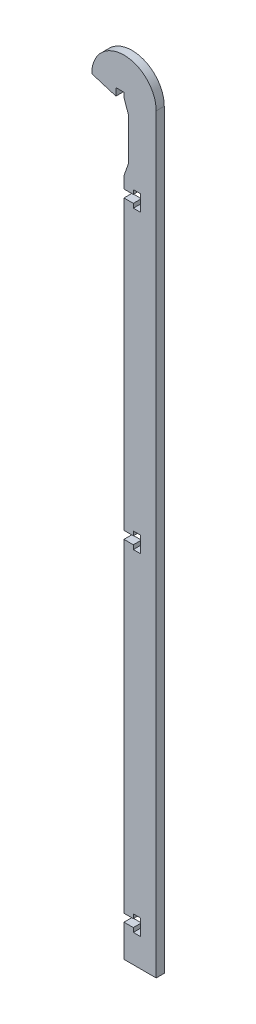
ISO-10303-21;
HEADER;
FILE_DESCRIPTION(('STEP AP214'),'2;1');
FILE_NAME('part.step','',(''),(''),'','','');
FILE_SCHEMA(('AUTOMOTIVE_DESIGN { 1 0 10303 214 1 1 1 1 }'));
ENDSEC;
DATA;
#1=APPLICATION_CONTEXT('core data for automotive mechanical design processes');
#2=APPLICATION_PROTOCOL_DEFINITION('international standard','automotive_design',2000,#1);
#3=PRODUCT_CONTEXT('',#1,'mechanical');
#4=PRODUCT('Part','Part','',(#3));
#5=PRODUCT_RELATED_PRODUCT_CATEGORY('part','',(#4));
#6=PRODUCT_DEFINITION_FORMATION('','',#4);
#7=PRODUCT_DEFINITION_CONTEXT('part definition',#1,'design');
#8=PRODUCT_DEFINITION('design','',#6,#7);
#9=PRODUCT_DEFINITION_SHAPE('','',#8);
#10=(LENGTH_UNIT() NAMED_UNIT(*) SI_UNIT(.MILLI.,.METRE.));
#11=(NAMED_UNIT(*) PLANE_ANGLE_UNIT() SI_UNIT($,.RADIAN.));
#12=(NAMED_UNIT(*) SI_UNIT($,.STERADIAN.) SOLID_ANGLE_UNIT());
#13=UNCERTAINTY_MEASURE_WITH_UNIT(LENGTH_MEASURE(1.E-05),#10,'distance_accuracy_value','');
#14=(GEOMETRIC_REPRESENTATION_CONTEXT(3) GLOBAL_UNCERTAINTY_ASSIGNED_CONTEXT((#13)) GLOBAL_UNIT_ASSIGNED_CONTEXT((#10,
#11,#12)) REPRESENTATION_CONTEXT('',''));
#15=CARTESIAN_POINT('',(0.,0.,0.));
#16=DIRECTION('',(0.,0.,1.));
#17=DIRECTION('',(1.,0.,0.));
#18=AXIS2_PLACEMENT_3D('',#15,#16,#17);
#19=CARTESIAN_POINT('',(0.,0.,3.175));
#20=DIRECTION('',(0.,1.,0.));
#21=DIRECTION('',(-1.,0.,0.));
#22=AXIS2_PLACEMENT_3D('',#19,#20,#21);
#23=PLANE('',#22);
#24=DIRECTION('',(1.,0.,0.));
#25=VECTOR('',#24,1.);
#26=CARTESIAN_POINT('',(0.,0.,0.));
#27=LINE('',#26,#25);
#28=CARTESIAN_POINT('',(-3.175,0.,0.));
#29=VERTEX_POINT('',#28);
#30=CARTESIAN_POINT('',(0.,0.,0.));
#31=VERTEX_POINT('',#30);
#32=EDGE_CURVE('E291',#29,#31,#27,.T.);
#33=ORIENTED_EDGE('',*,*,#32,.T.);
#34=DIRECTION('',(0.,0.,-1.));
#35=VECTOR('',#34,1.);
#36=CARTESIAN_POINT('',(0.,0.,3.175));
#37=LINE('',#36,#35);
#38=CARTESIAN_POINT('',(0.,0.,3.175));
#39=VERTEX_POINT('',#38);
#40=EDGE_CURVE('E11',#39,#31,#37,.T.);
#41=ORIENTED_EDGE('',*,*,#40,.F.);
#42=DIRECTION('',(1.,0.,0.));
#43=VECTOR('',#42,1.);
#44=CARTESIAN_POINT('',(0.,0.,3.175));
#45=LINE('',#44,#43);
#46=CARTESIAN_POINT('',(-3.175,0.,3.175));
#47=VERTEX_POINT('',#46);
#48=EDGE_CURVE('E359',#47,#39,#45,.T.);
#49=ORIENTED_EDGE('',*,*,#48,.F.);
#50=DIRECTION('',(0.,0.,-1.));
#51=VECTOR('',#50,1.);
#52=CARTESIAN_POINT('',(-3.175,0.,3.175));
#53=LINE('',#52,#51);
#54=EDGE_CURVE('E287',#47,#29,#53,.T.);
#55=ORIENTED_EDGE('',*,*,#54,.T.);
#56=EDGE_LOOP('',(#33,#41,#49,#55));
#57=FACE_BOUND('',#56,.T.);
#58=ADVANCED_FACE('F33',(#57),#23,.F.);
#59=CARTESIAN_POINT('',(0.,0.,3.175));
#60=DIRECTION('',(1.,0.,0.));
#61=DIRECTION('',(0.,1.,0.));
#62=AXIS2_PLACEMENT_3D('',#59,#60,#61);
#63=PLANE('',#62);
#64=DIRECTION('',(0.,-1.,0.));
#65=VECTOR('',#64,1.);
#66=CARTESIAN_POINT('',(0.,0.,0.));
#67=LINE('',#66,#65);
#68=CARTESIAN_POINT('',(0.,-1.8034,0.));
#69=VERTEX_POINT('',#68);
#70=EDGE_CURVE('E294',#31,#69,#67,.T.);
#71=ORIENTED_EDGE('',*,*,#70,.T.);
#72=DIRECTION('',(0.,0.,-1.));
#73=VECTOR('',#72,1.);
#74=CARTESIAN_POINT('',(0.,-1.8034,3.175));
#75=LINE('',#74,#73);
#76=CARTESIAN_POINT('',(0.,-1.8034,3.175));
#77=VERTEX_POINT('',#76);
#78=EDGE_CURVE('E41',#77,#69,#75,.T.);
#79=ORIENTED_EDGE('',*,*,#78,.F.);
#80=DIRECTION('',(0.,-1.,0.));
#81=VECTOR('',#80,1.);
#82=CARTESIAN_POINT('',(0.,0.,3.175));
#83=LINE('',#82,#81);
#84=EDGE_CURVE('E173',#39,#77,#83,.T.);
#85=ORIENTED_EDGE('',*,*,#84,.F.);
#86=ORIENTED_EDGE('',*,*,#40,.T.);
#87=EDGE_LOOP('',(#71,#79,#85,#86));
#88=FACE_BOUND('',#87,.T.);
#89=ADVANCED_FACE('F552',(#88),#63,.F.);
#90=CARTESIAN_POINT('',(0.,-1.8034,3.175));
#91=DIRECTION('',(0.943858356366017,0.330350424728106,0.));
#92=DIRECTION('',(-0.330350424728106,0.943858356366017,0.));
#93=AXIS2_PLACEMENT_3D('',#90,#91,#92);
#94=PLANE('',#93);
#95=DIRECTION('',(0.330350424728106,-0.943858356366017,0.));
#96=VECTOR('',#95,1.);
#97=CARTESIAN_POINT('',(0.,-1.8034,0.));
#98=LINE('',#97,#96);
#99=CARTESIAN_POINT('',(1.778,-6.8834,0.));
#100=VERTEX_POINT('',#99);
#101=EDGE_CURVE('E296',#69,#100,#98,.T.);
#102=ORIENTED_EDGE('',*,*,#101,.T.);
#103=DIRECTION('',(0.,0.,-1.));
#104=VECTOR('',#103,1.);
#105=CARTESIAN_POINT('',(1.778,-6.8834,3.175));
#106=LINE('',#105,#104);
#107=CARTESIAN_POINT('',(1.778,-6.8834,3.175));
#108=VERTEX_POINT('',#107);
#109=EDGE_CURVE('E447',#108,#100,#106,.T.);
#110=ORIENTED_EDGE('',*,*,#109,.F.);
#111=DIRECTION('',(0.330350424728106,-0.943858356366017,0.));
#112=VECTOR('',#111,1.);
#113=CARTESIAN_POINT('',(0.,-1.8034,3.175));
#114=LINE('',#113,#112);
#115=EDGE_CURVE('E455',#77,#108,#114,.T.);
#116=ORIENTED_EDGE('',*,*,#115,.F.);
#117=ORIENTED_EDGE('',*,*,#78,.T.);
#118=EDGE_LOOP('',(#102,#110,#116,#117));
#119=FACE_BOUND('',#118,.T.);
#120=ADVANCED_FACE('F453',(#119),#94,.F.);
#121=CARTESIAN_POINT('',(1.778,-6.8834,3.175));
#122=DIRECTION('',(1.,0.,0.));
#123=DIRECTION('',(0.,1.,0.));
#124=AXIS2_PLACEMENT_3D('',#121,#122,#123);
#125=PLANE('',#124);
#126=DIRECTION('',(0.,-1.,0.));
#127=VECTOR('',#126,1.);
#128=CARTESIAN_POINT('',(1.778,-6.8834,0.));
#129=LINE('',#128,#127);
#130=CARTESIAN_POINT('',(1.778,-23.3934,0.));
#131=VERTEX_POINT('',#130);
#132=EDGE_CURVE('E298',#100,#131,#129,.T.);
#133=ORIENTED_EDGE('',*,*,#132,.T.);
#134=DIRECTION('',(0.,0.,-1.));
#135=VECTOR('',#134,1.);
#136=CARTESIAN_POINT('',(1.778,-23.3934,3.175));
#137=LINE('',#136,#135);
#138=CARTESIAN_POINT('',(1.778,-23.3934,3.175));
#139=VERTEX_POINT('',#138);
#140=EDGE_CURVE('E444',#139,#131,#137,.T.);
#141=ORIENTED_EDGE('',*,*,#140,.F.);
#142=DIRECTION('',(0.,-1.,0.));
#143=VECTOR('',#142,1.);
#144=CARTESIAN_POINT('',(1.778,-6.8834,3.175));
#145=LINE('',#144,#143);
#146=EDGE_CURVE('E473',#108,#139,#145,.T.);
#147=ORIENTED_EDGE('',*,*,#146,.F.);
#148=ORIENTED_EDGE('',*,*,#109,.T.);
#149=EDGE_LOOP('',(#133,#141,#147,#148));
#150=FACE_BOUND('',#149,.T.);
#151=ADVANCED_FACE('F464',(#150),#125,.F.);
#152=CARTESIAN_POINT('',(1.778,-23.3934,3.175));
#153=DIRECTION('',(0.943858356366017,-0.330350424728106,0.));
#154=DIRECTION('',(0.330350424728106,0.943858356366017,0.));
#155=AXIS2_PLACEMENT_3D('',#152,#153,#154);
#156=PLANE('',#155);
#157=DIRECTION('',(-0.330350424728106,-0.943858356366017,0.));
#158=VECTOR('',#157,1.);
#159=CARTESIAN_POINT('',(1.778,-23.3934,0.));
#160=LINE('',#159,#158);
#161=CARTESIAN_POINT('',(0.,-28.4734,0.));
#162=VERTEX_POINT('',#161);
#163=EDGE_CURVE('E300',#131,#162,#160,.T.);
#164=ORIENTED_EDGE('',*,*,#163,.T.);
#165=DIRECTION('',(0.,0.,-1.));
#166=VECTOR('',#165,1.);
#167=CARTESIAN_POINT('',(0.,-28.4734,3.175));
#168=LINE('',#167,#166);
#169=CARTESIAN_POINT('',(0.,-28.4734,3.175));
#170=VERTEX_POINT('',#169);
#171=EDGE_CURVE('E441',#170,#162,#168,.T.);
#172=ORIENTED_EDGE('',*,*,#171,.F.);
#173=DIRECTION('',(-0.330350424728106,-0.943858356366017,0.));
#174=VECTOR('',#173,1.);
#175=CARTESIAN_POINT('',(1.778,-23.3934,3.175));
#176=LINE('',#175,#174);
#177=EDGE_CURVE('E470',#139,#170,#176,.T.);
#178=ORIENTED_EDGE('',*,*,#177,.F.);
#179=ORIENTED_EDGE('',*,*,#140,.T.);
#180=EDGE_LOOP('',(#164,#172,#178,#179));
#181=FACE_BOUND('',#180,.T.);
#182=ADVANCED_FACE('F468',(#181),#156,.F.);
#183=CARTESIAN_POINT('',(0.,-28.4734,3.175));
#184=DIRECTION('',(1.,0.,0.));
#185=DIRECTION('',(0.,1.,0.));
#186=AXIS2_PLACEMENT_3D('',#183,#184,#185);
#187=PLANE('',#186);
#188=DIRECTION('',(0.,-1.,0.));
#189=VECTOR('',#188,1.);
#190=CARTESIAN_POINT('',(0.,-28.4734,0.));
#191=LINE('',#190,#189);
#192=CARTESIAN_POINT('',(0.,-33.02,0.));
#193=VERTEX_POINT('',#192);
#194=EDGE_CURVE('E302',#162,#193,#191,.T.);
#195=ORIENTED_EDGE('',*,*,#194,.T.);
#196=DIRECTION('',(0.,0.,-1.));
#197=VECTOR('',#196,1.);
#198=CARTESIAN_POINT('',(0.,-33.02,3.175));
#199=LINE('',#198,#197);
#200=CARTESIAN_POINT('',(0.,-33.02,3.175));
#201=VERTEX_POINT('',#200);
#202=EDGE_CURVE('E438',#201,#193,#199,.T.);
#203=ORIENTED_EDGE('',*,*,#202,.F.);
#204=DIRECTION('',(0.,-1.,0.));
#205=VECTOR('',#204,1.);
#206=CARTESIAN_POINT('',(0.,-28.4734,3.175));
#207=LINE('',#206,#205);
#208=EDGE_CURVE('E472',#170,#201,#207,.T.);
#209=ORIENTED_EDGE('',*,*,#208,.F.);
#210=ORIENTED_EDGE('',*,*,#171,.T.);
#211=EDGE_LOOP('',(#195,#203,#209,#210));
#212=FACE_BOUND('',#211,.T.);
#213=ADVANCED_FACE('F565',(#212),#187,.F.);
#214=CARTESIAN_POINT('',(0.,-33.02,3.175));
#215=DIRECTION('',(0.,1.,0.));
#216=DIRECTION('',(0.,0.,1.));
#217=AXIS2_PLACEMENT_3D('',#214,#215,#216);
#218=PLANE('',#217);
#219=DIRECTION('',(1.,0.,0.));
#220=VECTOR('',#219,1.);
#221=CARTESIAN_POINT('',(0.,-33.02,0.));
#222=LINE('',#221,#220);
#223=CARTESIAN_POINT('',(3.68299999999999,-33.02,0.));
#224=VERTEX_POINT('',#223);
#225=EDGE_CURVE('E304',#193,#224,#222,.T.);
#226=ORIENTED_EDGE('',*,*,#225,.T.);
#227=DIRECTION('',(0.,0.,-1.));
#228=VECTOR('',#227,1.);
#229=CARTESIAN_POINT('',(3.68299999999999,-33.02,3.175));
#230=LINE('',#229,#228);
#231=CARTESIAN_POINT('',(3.68299999999999,-33.02,3.175));
#232=VERTEX_POINT('',#231);
#233=EDGE_CURVE('E435',#232,#224,#230,.T.);
#234=ORIENTED_EDGE('',*,*,#233,.F.);
#235=DIRECTION('',(1.,0.,0.));
#236=VECTOR('',#235,1.);
#237=CARTESIAN_POINT('',(0.,-33.02,3.175));
#238=LINE('',#237,#236);
#239=EDGE_CURVE('E475',#201,#232,#238,.T.);
#240=ORIENTED_EDGE('',*,*,#239,.F.);
#241=ORIENTED_EDGE('',*,*,#202,.T.);
#242=EDGE_LOOP('',(#226,#234,#240,#241));
#243=FACE_BOUND('',#242,.T.);
#244=ADVANCED_FACE('F568',(#243),#218,.F.);
#245=CARTESIAN_POINT('',(3.68299999999999,-33.02,3.175));
#246=DIRECTION('',(-1.,0.,0.));
#247=DIRECTION('',(0.,-1.,0.));
#248=AXIS2_PLACEMENT_3D('',#245,#246,#247);
#249=PLANE('',#248);
#250=DIRECTION('',(0.,1.,0.));
#251=VECTOR('',#250,1.);
#252=CARTESIAN_POINT('',(3.68299999999999,-33.02,0.));
#253=LINE('',#252,#251);
#254=CARTESIAN_POINT('',(3.68299999999999,-31.369,0.));
#255=VERTEX_POINT('',#254);
#256=EDGE_CURVE('E306',#224,#255,#253,.T.);
#257=ORIENTED_EDGE('',*,*,#256,.T.);
#258=DIRECTION('',(0.,0.,-1.));
#259=VECTOR('',#258,1.);
#260=CARTESIAN_POINT('',(3.68299999999999,-31.369,3.175));
#261=LINE('',#260,#259);
#262=CARTESIAN_POINT('',(3.68299999999999,-31.369,3.175));
#263=VERTEX_POINT('',#262);
#264=EDGE_CURVE('E432',#263,#255,#261,.T.);
#265=ORIENTED_EDGE('',*,*,#264,.F.);
#266=DIRECTION('',(0.,1.,0.));
#267=VECTOR('',#266,1.);
#268=CARTESIAN_POINT('',(3.68299999999999,-33.02,3.175));
#269=LINE('',#268,#267);
#270=EDGE_CURVE('E481',#232,#263,#269,.T.);
#271=ORIENTED_EDGE('',*,*,#270,.F.);
#272=ORIENTED_EDGE('',*,*,#233,.T.);
#273=EDGE_LOOP('',(#257,#265,#271,#272));
#274=FACE_BOUND('',#273,.T.);
#275=ADVANCED_FACE('F572',(#274),#249,.F.);
#276=CARTESIAN_POINT('',(3.68299999999999,-31.369,3.175));
#277=DIRECTION('',(0.,1.,0.));
#278=DIRECTION('',(-1.,0.,0.));
#279=AXIS2_PLACEMENT_3D('',#276,#277,#278);
#280=PLANE('',#279);
#281=DIRECTION('',(1.,0.,0.));
#282=VECTOR('',#281,1.);
#283=CARTESIAN_POINT('',(3.68299999999999,-31.369,0.));
#284=LINE('',#283,#282);
#285=CARTESIAN_POINT('',(6.477,-31.369,0.));
#286=VERTEX_POINT('',#285);
#287=EDGE_CURVE('E308',#255,#286,#284,.T.);
#288=ORIENTED_EDGE('',*,*,#287,.T.);
#289=DIRECTION('',(0.,0.,-1.));
#290=VECTOR('',#289,1.);
#291=CARTESIAN_POINT('',(6.477,-31.369,3.175));
#292=LINE('',#291,#290);
#293=CARTESIAN_POINT('',(6.477,-31.369,3.175));
#294=VERTEX_POINT('',#293);
#295=EDGE_CURVE('E429',#294,#286,#292,.T.);
#296=ORIENTED_EDGE('',*,*,#295,.F.);
#297=DIRECTION('',(1.,0.,0.));
#298=VECTOR('',#297,1.);
#299=CARTESIAN_POINT('',(3.68299999999999,-31.369,3.175));
#300=LINE('',#299,#298);
#301=EDGE_CURVE('E483',#263,#294,#300,.T.);
#302=ORIENTED_EDGE('',*,*,#301,.F.);
#303=ORIENTED_EDGE('',*,*,#264,.T.);
#304=EDGE_LOOP('',(#288,#296,#302,#303));
#305=FACE_BOUND('',#304,.T.);
#306=ADVANCED_FACE('F576',(#305),#280,.F.);
#307=CARTESIAN_POINT('',(6.477,-31.369,3.175));
#308=DIRECTION('',(1.,0.,0.));
#309=DIRECTION('',(0.,0.,-1.));
#310=AXIS2_PLACEMENT_3D('',#307,#308,#309);
#311=PLANE('',#310);
#312=DIRECTION('',(0.,-1.,0.));
#313=VECTOR('',#312,1.);
#314=CARTESIAN_POINT('',(6.477,-31.369,0.));
#315=LINE('',#314,#313);
#316=CARTESIAN_POINT('',(6.477,-37.719,0.));
#317=VERTEX_POINT('',#316);
#318=EDGE_CURVE('E310',#286,#317,#315,.T.);
#319=ORIENTED_EDGE('',*,*,#318,.T.);
#320=DIRECTION('',(0.,0.,-1.));
#321=VECTOR('',#320,1.);
#322=CARTESIAN_POINT('',(6.477,-37.719,3.175));
#323=LINE('',#322,#321);
#324=CARTESIAN_POINT('',(6.477,-37.719,3.175));
#325=VERTEX_POINT('',#324);
#326=EDGE_CURVE('E426',#325,#317,#323,.T.);
#327=ORIENTED_EDGE('',*,*,#326,.F.);
#328=DIRECTION('',(0.,-1.,0.));
#329=VECTOR('',#328,1.);
#330=CARTESIAN_POINT('',(6.477,-31.369,3.175));
#331=LINE('',#330,#329);
#332=EDGE_CURVE('E485',#294,#325,#331,.T.);
#333=ORIENTED_EDGE('',*,*,#332,.F.);
#334=ORIENTED_EDGE('',*,*,#295,.T.);
#335=EDGE_LOOP('',(#319,#327,#333,#334));
#336=FACE_BOUND('',#335,.T.);
#337=ADVANCED_FACE('F580',(#336),#311,.F.);
#338=CARTESIAN_POINT('',(6.477,-37.719,3.175));
#339=DIRECTION('',(0.,-1.,0.));
#340=DIRECTION('',(0.,0.,-1.));
#341=AXIS2_PLACEMENT_3D('',#338,#339,#340);
#342=PLANE('',#341);
#343=DIRECTION('',(-1.,0.,0.));
#344=VECTOR('',#343,1.);
#345=CARTESIAN_POINT('',(6.477,-37.719,0.));
#346=LINE('',#345,#344);
#347=CARTESIAN_POINT('',(3.68299999999999,-37.719,0.));
#348=VERTEX_POINT('',#347);
#349=EDGE_CURVE('E312',#317,#348,#346,.T.);
#350=ORIENTED_EDGE('',*,*,#349,.T.);
#351=DIRECTION('',(0.,0.,-1.));
#352=VECTOR('',#351,1.);
#353=CARTESIAN_POINT('',(3.68299999999999,-37.719,3.175));
#354=LINE('',#353,#352);
#355=CARTESIAN_POINT('',(3.68299999999999,-37.719,3.175));
#356=VERTEX_POINT('',#355);
#357=EDGE_CURVE('E423',#356,#348,#354,.T.);
#358=ORIENTED_EDGE('',*,*,#357,.F.);
#359=DIRECTION('',(-1.,0.,0.));
#360=VECTOR('',#359,1.);
#361=CARTESIAN_POINT('',(6.477,-37.719,3.175));
#362=LINE('',#361,#360);
#363=EDGE_CURVE('E487',#325,#356,#362,.T.);
#364=ORIENTED_EDGE('',*,*,#363,.F.);
#365=ORIENTED_EDGE('',*,*,#326,.T.);
#366=EDGE_LOOP('',(#350,#358,#364,#365));
#367=FACE_BOUND('',#366,.T.);
#368=ADVANCED_FACE('F584',(#367),#342,.F.);
#369=CARTESIAN_POINT('',(3.68299999999999,-37.719,3.175));
#370=DIRECTION('',(-1.,0.,0.));
#371=DIRECTION('',(0.,0.,1.));
#372=AXIS2_PLACEMENT_3D('',#369,#370,#371);
#373=PLANE('',#372);
#374=DIRECTION('',(0.,1.,0.));
#375=VECTOR('',#374,1.);
#376=CARTESIAN_POINT('',(3.68299999999999,-37.719,0.));
#377=LINE('',#376,#375);
#378=CARTESIAN_POINT('',(3.68299999999999,-36.068,0.));
#379=VERTEX_POINT('',#378);
#380=EDGE_CURVE('E314',#348,#379,#377,.T.);
#381=ORIENTED_EDGE('',*,*,#380,.T.);
#382=DIRECTION('',(0.,0.,-1.));
#383=VECTOR('',#382,1.);
#384=CARTESIAN_POINT('',(3.68299999999999,-36.068,3.175));
#385=LINE('',#384,#383);
#386=CARTESIAN_POINT('',(3.68299999999999,-36.068,3.175));
#387=VERTEX_POINT('',#386);
#388=EDGE_CURVE('E420',#387,#379,#385,.T.);
#389=ORIENTED_EDGE('',*,*,#388,.F.);
#390=DIRECTION('',(0.,1.,0.));
#391=VECTOR('',#390,1.);
#392=CARTESIAN_POINT('',(3.68299999999999,-37.719,3.175));
#393=LINE('',#392,#391);
#394=EDGE_CURVE('E489',#356,#387,#393,.T.);
#395=ORIENTED_EDGE('',*,*,#394,.F.);
#396=ORIENTED_EDGE('',*,*,#357,.T.);
#397=EDGE_LOOP('',(#381,#389,#395,#396));
#398=FACE_BOUND('',#397,.T.);
#399=ADVANCED_FACE('F588',(#398),#373,.F.);
#400=CARTESIAN_POINT('',(3.68299999999999,-36.068,3.175));
#401=DIRECTION('',(0.,-1.,0.));
#402=DIRECTION('',(0.,0.,-1.));
#403=AXIS2_PLACEMENT_3D('',#400,#401,#402);
#404=PLANE('',#403);
#405=DIRECTION('',(-1.,0.,0.));
#406=VECTOR('',#405,1.);
#407=CARTESIAN_POINT('',(3.68299999999999,-36.068,0.));
#408=LINE('',#407,#406);
#409=CARTESIAN_POINT('',(0.,-36.068,0.));
#410=VERTEX_POINT('',#409);
#411=EDGE_CURVE('E316',#379,#410,#408,.T.);
#412=ORIENTED_EDGE('',*,*,#411,.T.);
#413=DIRECTION('',(0.,0.,-1.));
#414=VECTOR('',#413,1.);
#415=CARTESIAN_POINT('',(0.,-36.068,3.175));
#416=LINE('',#415,#414);
#417=CARTESIAN_POINT('',(0.,-36.068,3.175));
#418=VERTEX_POINT('',#417);
#419=EDGE_CURVE('E417',#418,#410,#416,.T.);
#420=ORIENTED_EDGE('',*,*,#419,.F.);
#421=DIRECTION('',(-1.,0.,0.));
#422=VECTOR('',#421,1.);
#423=CARTESIAN_POINT('',(3.68299999999999,-36.068,3.175));
#424=LINE('',#423,#422);
#425=EDGE_CURVE('E491',#387,#418,#424,.T.);
#426=ORIENTED_EDGE('',*,*,#425,.F.);
#427=ORIENTED_EDGE('',*,*,#388,.T.);
#428=EDGE_LOOP('',(#412,#420,#426,#427));
#429=FACE_BOUND('',#428,.T.);
#430=ADVANCED_FACE('F592',(#429),#404,.F.);
#431=CARTESIAN_POINT('',(0.,-36.068,3.175));
#432=DIRECTION('',(1.,0.,0.));
#433=DIRECTION('',(0.,1.,0.));
#434=AXIS2_PLACEMENT_3D('',#431,#432,#433);
#435=PLANE('',#434);
#436=DIRECTION('',(0.,-1.,0.));
#437=VECTOR('',#436,1.);
#438=CARTESIAN_POINT('',(0.,-36.068,0.));
#439=LINE('',#438,#437);
#440=CARTESIAN_POINT('',(0.,-149.521333333334,0.));
#441=VERTEX_POINT('',#440);
#442=EDGE_CURVE('E318',#410,#441,#439,.T.);
#443=ORIENTED_EDGE('',*,*,#442,.T.);
#444=DIRECTION('',(0.,0.,-1.));
#445=VECTOR('',#444,1.);
#446=CARTESIAN_POINT('',(0.,-149.521333333334,3.175));
#447=LINE('',#446,#445);
#448=CARTESIAN_POINT('',(0.,-149.521333333334,3.175));
#449=VERTEX_POINT('',#448);
#450=EDGE_CURVE('E414',#449,#441,#447,.T.);
#451=ORIENTED_EDGE('',*,*,#450,.F.);
#452=DIRECTION('',(0.,-1.,0.));
#453=VECTOR('',#452,1.);
#454=CARTESIAN_POINT('',(0.,-36.068,3.175));
#455=LINE('',#454,#453);
#456=EDGE_CURVE('E493',#418,#449,#455,.T.);
#457=ORIENTED_EDGE('',*,*,#456,.F.);
#458=ORIENTED_EDGE('',*,*,#419,.T.);
#459=EDGE_LOOP('',(#443,#451,#457,#458));
#460=FACE_BOUND('',#459,.T.);
#461=ADVANCED_FACE('F596',(#460),#435,.F.);
#462=CARTESIAN_POINT('',(3.68299999999999,-149.521333333334,3.175));
#463=DIRECTION('',(0.,1.,0.));
#464=DIRECTION('',(0.,0.,1.));
#465=AXIS2_PLACEMENT_3D('',#462,#463,#464);
#466=PLANE('',#465);
#467=DIRECTION('',(1.,0.,0.));
#468=VECTOR('',#467,1.);
#469=CARTESIAN_POINT('',(3.68299999999999,-149.521333333334,0.));
#470=LINE('',#469,#468);
#471=CARTESIAN_POINT('',(3.68299999999999,-149.521333333334,0.));
#472=VERTEX_POINT('',#471);
#473=EDGE_CURVE('E320',#441,#472,#470,.T.);
#474=ORIENTED_EDGE('',*,*,#473,.T.);
#475=DIRECTION('',(0.,0.,-1.));
#476=VECTOR('',#475,1.);
#477=CARTESIAN_POINT('',(3.68299999999999,-149.521333333334,3.175));
#478=LINE('',#477,#476);
#479=CARTESIAN_POINT('',(3.68299999999999,-149.521333333334,3.175));
#480=VERTEX_POINT('',#479);
#481=EDGE_CURVE('E411',#480,#472,#478,.T.);
#482=ORIENTED_EDGE('',*,*,#481,.F.);
#483=DIRECTION('',(1.,0.,0.));
#484=VECTOR('',#483,1.);
#485=CARTESIAN_POINT('',(3.68299999999999,-149.521333333334,3.175));
#486=LINE('',#485,#484);
#487=EDGE_CURVE('E495',#449,#480,#486,.T.);
#488=ORIENTED_EDGE('',*,*,#487,.F.);
#489=ORIENTED_EDGE('',*,*,#450,.T.);
#490=EDGE_LOOP('',(#474,#482,#488,#489));
#491=FACE_BOUND('',#490,.T.);
#492=ADVANCED_FACE('F600',(#491),#466,.F.);
#493=CARTESIAN_POINT('',(3.68299999999999,-147.870333333334,3.175));
#494=DIRECTION('',(-1.,0.,0.));
#495=DIRECTION('',(0.,0.,1.));
#496=AXIS2_PLACEMENT_3D('',#493,#494,#495);
#497=PLANE('',#496);
#498=DIRECTION('',(0.,1.,0.));
#499=VECTOR('',#498,1.);
#500=CARTESIAN_POINT('',(3.68299999999999,-147.870333333334,0.));
#501=LINE('',#500,#499);
#502=CARTESIAN_POINT('',(3.68299999999999,-147.870333333334,0.));
#503=VERTEX_POINT('',#502);
#504=EDGE_CURVE('E322',#472,#503,#501,.T.);
#505=ORIENTED_EDGE('',*,*,#504,.T.);
#506=DIRECTION('',(0.,0.,-1.));
#507=VECTOR('',#506,1.);
#508=CARTESIAN_POINT('',(3.68299999999999,-147.870333333334,3.175));
#509=LINE('',#508,#507);
#510=CARTESIAN_POINT('',(3.68299999999999,-147.870333333334,3.175));
#511=VERTEX_POINT('',#510);
#512=EDGE_CURVE('E408',#511,#503,#509,.T.);
#513=ORIENTED_EDGE('',*,*,#512,.F.);
#514=DIRECTION('',(0.,1.,0.));
#515=VECTOR('',#514,1.);
#516=CARTESIAN_POINT('',(3.68299999999999,-147.870333333334,3.175));
#517=LINE('',#516,#515);
#518=EDGE_CURVE('E497',#480,#511,#517,.T.);
#519=ORIENTED_EDGE('',*,*,#518,.F.);
#520=ORIENTED_EDGE('',*,*,#481,.T.);
#521=EDGE_LOOP('',(#505,#513,#519,#520));
#522=FACE_BOUND('',#521,.T.);
#523=ADVANCED_FACE('F604',(#522),#497,.F.);
#524=CARTESIAN_POINT('',(6.47699999999999,-147.870333333334,3.175));
#525=DIRECTION('',(0.,1.,0.));
#526=DIRECTION('',(0.,0.,1.));
#527=AXIS2_PLACEMENT_3D('',#524,#525,#526);
#528=PLANE('',#527);
#529=DIRECTION('',(1.,0.,0.));
#530=VECTOR('',#529,1.);
#531=CARTESIAN_POINT('',(6.47699999999999,-147.870333333334,0.));
#532=LINE('',#531,#530);
#533=CARTESIAN_POINT('',(6.47699999999999,-147.870333333334,0.));
#534=VERTEX_POINT('',#533);
#535=EDGE_CURVE('E324',#503,#534,#532,.T.);
#536=ORIENTED_EDGE('',*,*,#535,.T.);
#537=DIRECTION('',(0.,0.,-1.));
#538=VECTOR('',#537,1.);
#539=CARTESIAN_POINT('',(6.47699999999999,-147.870333333334,3.175));
#540=LINE('',#539,#538);
#541=CARTESIAN_POINT('',(6.47699999999999,-147.870333333334,3.175));
#542=VERTEX_POINT('',#541);
#543=EDGE_CURVE('E405',#542,#534,#540,.T.);
#544=ORIENTED_EDGE('',*,*,#543,.F.);
#545=DIRECTION('',(1.,0.,0.));
#546=VECTOR('',#545,1.);
#547=CARTESIAN_POINT('',(6.47699999999999,-147.870333333334,3.175));
#548=LINE('',#547,#546);
#549=EDGE_CURVE('E499',#511,#542,#548,.T.);
#550=ORIENTED_EDGE('',*,*,#549,.F.);
#551=ORIENTED_EDGE('',*,*,#512,.T.);
#552=EDGE_LOOP('',(#536,#544,#550,#551));
#553=FACE_BOUND('',#552,.T.);
#554=ADVANCED_FACE('F608',(#553),#528,.F.);
#555=CARTESIAN_POINT('',(6.47699999999999,-154.220333333334,3.175));
#556=DIRECTION('',(1.,0.,0.));
#557=DIRECTION('',(0.,1.,0.));
#558=AXIS2_PLACEMENT_3D('',#555,#556,#557);
#559=PLANE('',#558);
#560=DIRECTION('',(0.,-1.,0.));
#561=VECTOR('',#560,1.);
#562=CARTESIAN_POINT('',(6.47699999999999,-154.220333333334,0.));
#563=LINE('',#562,#561);
#564=CARTESIAN_POINT('',(6.47699999999999,-154.220333333334,0.));
#565=VERTEX_POINT('',#564);
#566=EDGE_CURVE('E326',#534,#565,#563,.T.);
#567=ORIENTED_EDGE('',*,*,#566,.T.);
#568=DIRECTION('',(0.,0.,-1.));
#569=VECTOR('',#568,1.);
#570=CARTESIAN_POINT('',(6.47699999999999,-154.220333333334,3.175));
#571=LINE('',#570,#569);
#572=CARTESIAN_POINT('',(6.47699999999999,-154.220333333334,3.175));
#573=VERTEX_POINT('',#572);
#574=EDGE_CURVE('E402',#573,#565,#571,.T.);
#575=ORIENTED_EDGE('',*,*,#574,.F.);
#576=DIRECTION('',(0.,-1.,0.));
#577=VECTOR('',#576,1.);
#578=CARTESIAN_POINT('',(6.47699999999999,-154.220333333334,3.175));
#579=LINE('',#578,#577);
#580=EDGE_CURVE('E501',#542,#573,#579,.T.);
#581=ORIENTED_EDGE('',*,*,#580,.F.);
#582=ORIENTED_EDGE('',*,*,#543,.T.);
#583=EDGE_LOOP('',(#567,#575,#581,#582));
#584=FACE_BOUND('',#583,.T.);
#585=ADVANCED_FACE('F612',(#584),#559,.F.);
#586=CARTESIAN_POINT('',(3.68299999999999,-154.220333333334,3.175));
#587=DIRECTION('',(0.,-1.,0.));
#588=DIRECTION('',(1.,0.,0.));
#589=AXIS2_PLACEMENT_3D('',#586,#587,#588);
#590=PLANE('',#589);
#591=DIRECTION('',(-1.,0.,0.));
#592=VECTOR('',#591,1.);
#593=CARTESIAN_POINT('',(3.68299999999999,-154.220333333334,0.));
#594=LINE('',#593,#592);
#595=CARTESIAN_POINT('',(3.68299999999999,-154.220333333334,0.));
#596=VERTEX_POINT('',#595);
#597=EDGE_CURVE('E328',#565,#596,#594,.T.);
#598=ORIENTED_EDGE('',*,*,#597,.T.);
#599=DIRECTION('',(0.,0.,-1.));
#600=VECTOR('',#599,1.);
#601=CARTESIAN_POINT('',(3.68299999999999,-154.220333333334,3.175));
#602=LINE('',#601,#600);
#603=CARTESIAN_POINT('',(3.68299999999999,-154.220333333334,3.175));
#604=VERTEX_POINT('',#603);
#605=EDGE_CURVE('E399',#604,#596,#602,.T.);
#606=ORIENTED_EDGE('',*,*,#605,.F.);
#607=DIRECTION('',(-1.,0.,0.));
#608=VECTOR('',#607,1.);
#609=CARTESIAN_POINT('',(3.68299999999999,-154.220333333334,3.175));
#610=LINE('',#609,#608);
#611=EDGE_CURVE('E503',#573,#604,#610,.T.);
#612=ORIENTED_EDGE('',*,*,#611,.F.);
#613=ORIENTED_EDGE('',*,*,#574,.T.);
#614=EDGE_LOOP('',(#598,#606,#612,#613));
#615=FACE_BOUND('',#614,.T.);
#616=ADVANCED_FACE('F616',(#615),#590,.F.);
#617=CARTESIAN_POINT('',(3.68299999999999,-152.569333333334,3.175));
#618=DIRECTION('',(-1.,0.,0.));
#619=DIRECTION('',(0.,0.,1.));
#620=AXIS2_PLACEMENT_3D('',#617,#618,#619);
#621=PLANE('',#620);
#622=DIRECTION('',(0.,1.,0.));
#623=VECTOR('',#622,1.);
#624=CARTESIAN_POINT('',(3.68299999999999,-152.569333333334,0.));
#625=LINE('',#624,#623);
#626=CARTESIAN_POINT('',(3.68299999999999,-152.569333333334,0.));
#627=VERTEX_POINT('',#626);
#628=EDGE_CURVE('E330',#596,#627,#625,.T.);
#629=ORIENTED_EDGE('',*,*,#628,.T.);
#630=DIRECTION('',(0.,0.,-1.));
#631=VECTOR('',#630,1.);
#632=CARTESIAN_POINT('',(3.68299999999999,-152.569333333334,3.175));
#633=LINE('',#632,#631);
#634=CARTESIAN_POINT('',(3.68299999999999,-152.569333333334,3.175));
#635=VERTEX_POINT('',#634);
#636=EDGE_CURVE('E396',#635,#627,#633,.T.);
#637=ORIENTED_EDGE('',*,*,#636,.F.);
#638=DIRECTION('',(0.,1.,0.));
#639=VECTOR('',#638,1.);
#640=CARTESIAN_POINT('',(3.68299999999999,-152.569333333334,3.175));
#641=LINE('',#640,#639);
#642=EDGE_CURVE('E505',#604,#635,#641,.T.);
#643=ORIENTED_EDGE('',*,*,#642,.F.);
#644=ORIENTED_EDGE('',*,*,#605,.T.);
#645=EDGE_LOOP('',(#629,#637,#643,#644));
#646=FACE_BOUND('',#645,.T.);
#647=ADVANCED_FACE('F620',(#646),#621,.F.);
#648=CARTESIAN_POINT('',(0.,-152.569333333334,3.175));
#649=DIRECTION('',(0.,-1.,0.));
#650=DIRECTION('',(0.,0.,-1.));
#651=AXIS2_PLACEMENT_3D('',#648,#649,#650);
#652=PLANE('',#651);
#653=DIRECTION('',(-1.,0.,0.));
#654=VECTOR('',#653,1.);
#655=CARTESIAN_POINT('',(0.,-152.569333333334,0.));
#656=LINE('',#655,#654);
#657=CARTESIAN_POINT('',(0.,-152.569333333334,0.));
#658=VERTEX_POINT('',#657);
#659=EDGE_CURVE('E332',#627,#658,#656,.T.);
#660=ORIENTED_EDGE('',*,*,#659,.T.);
#661=DIRECTION('',(0.,0.,-1.));
#662=VECTOR('',#661,1.);
#663=CARTESIAN_POINT('',(0.,-152.569333333334,3.175));
#664=LINE('',#663,#662);
#665=CARTESIAN_POINT('',(0.,-152.569333333334,3.175));
#666=VERTEX_POINT('',#665);
#667=EDGE_CURVE('E393',#666,#658,#664,.T.);
#668=ORIENTED_EDGE('',*,*,#667,.F.);
#669=DIRECTION('',(-1.,0.,0.));
#670=VECTOR('',#669,1.);
#671=CARTESIAN_POINT('',(0.,-152.569333333334,3.175));
#672=LINE('',#671,#670);
#673=EDGE_CURVE('E507',#635,#666,#672,.T.);
#674=ORIENTED_EDGE('',*,*,#673,.F.);
#675=ORIENTED_EDGE('',*,*,#636,.T.);
#676=EDGE_LOOP('',(#660,#668,#674,#675));
#677=FACE_BOUND('',#676,.T.);
#678=ADVANCED_FACE('F624',(#677),#652,.F.);
#679=CARTESIAN_POINT('',(0.,-152.569333333334,3.175));
#680=DIRECTION('',(1.,0.,0.));
#681=DIRECTION('',(0.,1.,0.));
#682=AXIS2_PLACEMENT_3D('',#679,#680,#681);
#683=PLANE('',#682);
#684=DIRECTION('',(0.,-1.,0.));
#685=VECTOR('',#684,1.);
#686=CARTESIAN_POINT('',(0.,-152.569333333334,0.));
#687=LINE('',#686,#685);
#688=CARTESIAN_POINT('',(0.,-280.162,0.));
#689=VERTEX_POINT('',#688);
#690=EDGE_CURVE('E334',#658,#689,#687,.T.);
#691=ORIENTED_EDGE('',*,*,#690,.T.);
#692=DIRECTION('',(0.,0.,-1.));
#693=VECTOR('',#692,1.);
#694=CARTESIAN_POINT('',(0.,-280.162,3.175));
#695=LINE('',#694,#693);
#696=CARTESIAN_POINT('',(0.,-280.162,3.175));
#697=VERTEX_POINT('',#696);
#698=EDGE_CURVE('E390',#697,#689,#695,.T.);
#699=ORIENTED_EDGE('',*,*,#698,.F.);
#700=DIRECTION('',(0.,-1.,0.));
#701=VECTOR('',#700,1.);
#702=CARTESIAN_POINT('',(0.,-152.569333333334,3.175));
#703=LINE('',#702,#701);
#704=EDGE_CURVE('E509',#666,#697,#703,.T.);
#705=ORIENTED_EDGE('',*,*,#704,.F.);
#706=ORIENTED_EDGE('',*,*,#667,.T.);
#707=EDGE_LOOP('',(#691,#699,#705,#706));
#708=FACE_BOUND('',#707,.T.);
#709=ADVANCED_FACE('F628',(#708),#683,.F.);
#710=CARTESIAN_POINT('',(0.,-280.162,3.175));
#711=DIRECTION('',(0.,1.,0.));
#712=DIRECTION('',(0.,0.,1.));
#713=AXIS2_PLACEMENT_3D('',#710,#711,#712);
#714=PLANE('',#713);
#715=DIRECTION('',(1.,0.,0.));
#716=VECTOR('',#715,1.);
#717=CARTESIAN_POINT('',(0.,-280.162,0.));
#718=LINE('',#717,#716);
#719=CARTESIAN_POINT('',(3.683,-280.162,0.));
#720=VERTEX_POINT('',#719);
#721=EDGE_CURVE('E336',#689,#720,#718,.T.);
#722=ORIENTED_EDGE('',*,*,#721,.T.);
#723=DIRECTION('',(0.,0.,-1.));
#724=VECTOR('',#723,1.);
#725=CARTESIAN_POINT('',(3.683,-280.162,3.175));
#726=LINE('',#725,#724);
#727=CARTESIAN_POINT('',(3.683,-280.162,3.175));
#728=VERTEX_POINT('',#727);
#729=EDGE_CURVE('E387',#728,#720,#726,.T.);
#730=ORIENTED_EDGE('',*,*,#729,.F.);
#731=DIRECTION('',(1.,0.,0.));
#732=VECTOR('',#731,1.);
#733=CARTESIAN_POINT('',(0.,-280.162,3.175));
#734=LINE('',#733,#732);
#735=EDGE_CURVE('E511',#697,#728,#734,.T.);
#736=ORIENTED_EDGE('',*,*,#735,.F.);
#737=ORIENTED_EDGE('',*,*,#698,.T.);
#738=EDGE_LOOP('',(#722,#730,#736,#737));
#739=FACE_BOUND('',#738,.T.);
#740=ADVANCED_FACE('F632',(#739),#714,.F.);
#741=CARTESIAN_POINT('',(3.683,-280.162,3.175));
#742=DIRECTION('',(-1.,0.,0.));
#743=DIRECTION('',(0.,0.,1.));
#744=AXIS2_PLACEMENT_3D('',#741,#742,#743);
#745=PLANE('',#744);
#746=DIRECTION('',(0.,1.,0.));
#747=VECTOR('',#746,1.);
#748=CARTESIAN_POINT('',(3.683,-280.162,0.));
#749=LINE('',#748,#747);
#750=CARTESIAN_POINT('',(3.683,-278.511,0.));
#751=VERTEX_POINT('',#750);
#752=EDGE_CURVE('E338',#720,#751,#749,.T.);
#753=ORIENTED_EDGE('',*,*,#752,.T.);
#754=DIRECTION('',(0.,0.,-1.));
#755=VECTOR('',#754,1.);
#756=CARTESIAN_POINT('',(3.683,-278.511,3.175));
#757=LINE('',#756,#755);
#758=CARTESIAN_POINT('',(3.683,-278.511,3.175));
#759=VERTEX_POINT('',#758);
#760=EDGE_CURVE('E384',#759,#751,#757,.T.);
#761=ORIENTED_EDGE('',*,*,#760,.F.);
#762=DIRECTION('',(0.,1.,0.));
#763=VECTOR('',#762,1.);
#764=CARTESIAN_POINT('',(3.683,-280.162,3.175));
#765=LINE('',#764,#763);
#766=EDGE_CURVE('E513',#728,#759,#765,.T.);
#767=ORIENTED_EDGE('',*,*,#766,.F.);
#768=ORIENTED_EDGE('',*,*,#729,.T.);
#769=EDGE_LOOP('',(#753,#761,#767,#768));
#770=FACE_BOUND('',#769,.T.);
#771=ADVANCED_FACE('F636',(#770),#745,.F.);
#772=CARTESIAN_POINT('',(3.683,-278.511,3.175));
#773=DIRECTION('',(0.,1.,0.));
#774=DIRECTION('',(0.,0.,1.));
#775=AXIS2_PLACEMENT_3D('',#772,#773,#774);
#776=PLANE('',#775);
#777=DIRECTION('',(1.,0.,0.));
#778=VECTOR('',#777,1.);
#779=CARTESIAN_POINT('',(3.683,-278.511,0.));
#780=LINE('',#779,#778);
#781=CARTESIAN_POINT('',(6.477,-278.511,0.));
#782=VERTEX_POINT('',#781);
#783=EDGE_CURVE('E340',#751,#782,#780,.T.);
#784=ORIENTED_EDGE('',*,*,#783,.T.);
#785=DIRECTION('',(0.,0.,-1.));
#786=VECTOR('',#785,1.);
#787=CARTESIAN_POINT('',(6.477,-278.511,3.175));
#788=LINE('',#787,#786);
#789=CARTESIAN_POINT('',(6.477,-278.511,3.175));
#790=VERTEX_POINT('',#789);
#791=EDGE_CURVE('E381',#790,#782,#788,.T.);
#792=ORIENTED_EDGE('',*,*,#791,.F.);
#793=DIRECTION('',(1.,0.,0.));
#794=VECTOR('',#793,1.);
#795=CARTESIAN_POINT('',(3.683,-278.511,3.175));
#796=LINE('',#795,#794);
#797=EDGE_CURVE('E515',#759,#790,#796,.T.);
#798=ORIENTED_EDGE('',*,*,#797,.F.);
#799=ORIENTED_EDGE('',*,*,#760,.T.);
#800=EDGE_LOOP('',(#784,#792,#798,#799));
#801=FACE_BOUND('',#800,.T.);
#802=ADVANCED_FACE('F640',(#801),#776,.F.);
#803=CARTESIAN_POINT('',(6.477,-278.511,3.175));
#804=DIRECTION('',(1.,0.,0.));
#805=DIRECTION('',(0.,1.,0.));
#806=AXIS2_PLACEMENT_3D('',#803,#804,#805);
#807=PLANE('',#806);
#808=DIRECTION('',(0.,-1.,0.));
#809=VECTOR('',#808,1.);
#810=CARTESIAN_POINT('',(6.477,-278.511,0.));
#811=LINE('',#810,#809);
#812=CARTESIAN_POINT('',(6.477,-284.861,0.));
#813=VERTEX_POINT('',#812);
#814=EDGE_CURVE('E342',#782,#813,#811,.T.);
#815=ORIENTED_EDGE('',*,*,#814,.T.);
#816=DIRECTION('',(0.,0.,-1.));
#817=VECTOR('',#816,1.);
#818=CARTESIAN_POINT('',(6.477,-284.861,3.175));
#819=LINE('',#818,#817);
#820=CARTESIAN_POINT('',(6.477,-284.861,3.175));
#821=VERTEX_POINT('',#820);
#822=EDGE_CURVE('E378',#821,#813,#819,.T.);
#823=ORIENTED_EDGE('',*,*,#822,.F.);
#824=DIRECTION('',(0.,-1.,0.));
#825=VECTOR('',#824,1.);
#826=CARTESIAN_POINT('',(6.477,-278.511,3.175));
#827=LINE('',#826,#825);
#828=EDGE_CURVE('E517',#790,#821,#827,.T.);
#829=ORIENTED_EDGE('',*,*,#828,.F.);
#830=ORIENTED_EDGE('',*,*,#791,.T.);
#831=EDGE_LOOP('',(#815,#823,#829,#830));
#832=FACE_BOUND('',#831,.T.);
#833=ADVANCED_FACE('F644',(#832),#807,.F.);
#834=CARTESIAN_POINT('',(6.477,-284.861,3.175));
#835=DIRECTION('',(0.,-1.,0.));
#836=DIRECTION('',(0.,0.,-1.));
#837=AXIS2_PLACEMENT_3D('',#834,#835,#836);
#838=PLANE('',#837);
#839=DIRECTION('',(-1.,0.,0.));
#840=VECTOR('',#839,1.);
#841=CARTESIAN_POINT('',(6.477,-284.861,0.));
#842=LINE('',#841,#840);
#843=CARTESIAN_POINT('',(3.68299999999999,-284.861,0.));
#844=VERTEX_POINT('',#843);
#845=EDGE_CURVE('E344',#813,#844,#842,.T.);
#846=ORIENTED_EDGE('',*,*,#845,.T.);
#847=DIRECTION('',(0.,0.,-1.));
#848=VECTOR('',#847,1.);
#849=CARTESIAN_POINT('',(3.68299999999999,-284.861,3.175));
#850=LINE('',#849,#848);
#851=CARTESIAN_POINT('',(3.68299999999999,-284.861,3.175));
#852=VERTEX_POINT('',#851);
#853=EDGE_CURVE('E375',#852,#844,#850,.T.);
#854=ORIENTED_EDGE('',*,*,#853,.F.);
#855=DIRECTION('',(-1.,0.,0.));
#856=VECTOR('',#855,1.);
#857=CARTESIAN_POINT('',(6.477,-284.861,3.175));
#858=LINE('',#857,#856);
#859=EDGE_CURVE('E519',#821,#852,#858,.T.);
#860=ORIENTED_EDGE('',*,*,#859,.F.);
#861=ORIENTED_EDGE('',*,*,#822,.T.);
#862=EDGE_LOOP('',(#846,#854,#860,#861));
#863=FACE_BOUND('',#862,.T.);
#864=ADVANCED_FACE('F648',(#863),#838,.F.);
#865=CARTESIAN_POINT('',(3.68299999999999,-284.861,3.175));
#866=DIRECTION('',(-1.,0.,0.));
#867=DIRECTION('',(0.,0.,1.));
#868=AXIS2_PLACEMENT_3D('',#865,#866,#867);
#869=PLANE('',#868);
#870=DIRECTION('',(0.,1.,0.));
#871=VECTOR('',#870,1.);
#872=CARTESIAN_POINT('',(3.68299999999999,-284.861,0.));
#873=LINE('',#872,#871);
#874=CARTESIAN_POINT('',(3.68299999999999,-283.21,0.));
#875=VERTEX_POINT('',#874);
#876=EDGE_CURVE('E346',#844,#875,#873,.T.);
#877=ORIENTED_EDGE('',*,*,#876,.T.);
#878=DIRECTION('',(0.,0.,-1.));
#879=VECTOR('',#878,1.);
#880=CARTESIAN_POINT('',(3.68299999999999,-283.21,3.175));
#881=LINE('',#880,#879);
#882=CARTESIAN_POINT('',(3.68299999999999,-283.21,3.175));
#883=VERTEX_POINT('',#882);
#884=EDGE_CURVE('E372',#883,#875,#881,.T.);
#885=ORIENTED_EDGE('',*,*,#884,.F.);
#886=DIRECTION('',(0.,1.,0.));
#887=VECTOR('',#886,1.);
#888=CARTESIAN_POINT('',(3.68299999999999,-284.861,3.175));
#889=LINE('',#888,#887);
#890=EDGE_CURVE('E521',#852,#883,#889,.T.);
#891=ORIENTED_EDGE('',*,*,#890,.F.);
#892=ORIENTED_EDGE('',*,*,#853,.T.);
#893=EDGE_LOOP('',(#877,#885,#891,#892));
#894=FACE_BOUND('',#893,.T.);
#895=ADVANCED_FACE('F652',(#894),#869,.F.);
#896=CARTESIAN_POINT('',(3.68299999999999,-283.21,3.175));
#897=DIRECTION('',(0.,-1.,0.));
#898=DIRECTION('',(0.,0.,-1.));
#899=AXIS2_PLACEMENT_3D('',#896,#897,#898);
#900=PLANE('',#899);
#901=DIRECTION('',(-1.,0.,0.));
#902=VECTOR('',#901,1.);
#903=CARTESIAN_POINT('',(3.68299999999999,-283.21,0.));
#904=LINE('',#903,#902);
#905=CARTESIAN_POINT('',(0.,-283.21,0.));
#906=VERTEX_POINT('',#905);
#907=EDGE_CURVE('E348',#875,#906,#904,.T.);
#908=ORIENTED_EDGE('',*,*,#907,.T.);
#909=DIRECTION('',(0.,0.,-1.));
#910=VECTOR('',#909,1.);
#911=CARTESIAN_POINT('',(0.,-283.21,3.175));
#912=LINE('',#911,#910);
#913=CARTESIAN_POINT('',(0.,-283.21,3.175));
#914=VERTEX_POINT('',#913);
#915=EDGE_CURVE('E369',#914,#906,#912,.T.);
#916=ORIENTED_EDGE('',*,*,#915,.F.);
#917=DIRECTION('',(-1.,0.,0.));
#918=VECTOR('',#917,1.);
#919=CARTESIAN_POINT('',(3.68299999999999,-283.21,3.175));
#920=LINE('',#919,#918);
#921=EDGE_CURVE('E523',#883,#914,#920,.T.);
#922=ORIENTED_EDGE('',*,*,#921,.F.);
#923=ORIENTED_EDGE('',*,*,#884,.T.);
#924=EDGE_LOOP('',(#908,#916,#922,#923));
#925=FACE_BOUND('',#924,.T.);
#926=ADVANCED_FACE('F656',(#925),#900,.F.);
#927=CARTESIAN_POINT('',(0.,-283.21,3.175));
#928=DIRECTION('',(1.,0.,0.));
#929=DIRECTION('',(0.,1.,0.));
#930=AXIS2_PLACEMENT_3D('',#927,#928,#929);
#931=PLANE('',#930);
#932=DIRECTION('',(0.,-1.,0.));
#933=VECTOR('',#932,1.);
#934=CARTESIAN_POINT('',(0.,-283.21,0.));
#935=LINE('',#934,#933);
#936=CARTESIAN_POINT('',(0.,-295.91,0.));
#937=VERTEX_POINT('',#936);
#938=EDGE_CURVE('E350',#906,#937,#935,.T.);
#939=ORIENTED_EDGE('',*,*,#938,.T.);
#940=DIRECTION('',(0.,0.,-1.));
#941=VECTOR('',#940,1.);
#942=CARTESIAN_POINT('',(0.,-295.91,3.175));
#943=LINE('',#942,#941);
#944=CARTESIAN_POINT('',(0.,-295.91,3.175));
#945=VERTEX_POINT('',#944);
#946=EDGE_CURVE('E366',#945,#937,#943,.T.);
#947=ORIENTED_EDGE('',*,*,#946,.F.);
#948=DIRECTION('',(0.,-1.,0.));
#949=VECTOR('',#948,1.);
#950=CARTESIAN_POINT('',(0.,-283.21,3.175));
#951=LINE('',#950,#949);
#952=EDGE_CURVE('E525',#914,#945,#951,.T.);
#953=ORIENTED_EDGE('',*,*,#952,.F.);
#954=ORIENTED_EDGE('',*,*,#915,.T.);
#955=EDGE_LOOP('',(#939,#947,#953,#954));
#956=FACE_BOUND('',#955,.T.);
#957=ADVANCED_FACE('F660',(#956),#931,.F.);
#958=CARTESIAN_POINT('',(0.,-295.91,3.175));
#959=DIRECTION('',(0.,1.,0.));
#960=DIRECTION('',(0.,0.,1.));
#961=AXIS2_PLACEMENT_3D('',#958,#959,#960);
#962=PLANE('',#961);
#963=DIRECTION('',(1.,0.,0.));
#964=VECTOR('',#963,1.);
#965=CARTESIAN_POINT('',(0.,-295.91,0.));
#966=LINE('',#965,#964);
#967=CARTESIAN_POINT('',(12.7000000000001,-295.91,0.));
#968=VERTEX_POINT('',#967);
#969=EDGE_CURVE('E352',#937,#968,#966,.T.);
#970=ORIENTED_EDGE('',*,*,#969,.T.);
#971=DIRECTION('',(0.,0.,-1.));
#972=VECTOR('',#971,1.);
#973=CARTESIAN_POINT('',(12.7000000000001,-295.91,3.175));
#974=LINE('',#973,#972);
#975=CARTESIAN_POINT('',(12.7000000000001,-295.91,3.175));
#976=VERTEX_POINT('',#975);
#977=EDGE_CURVE('E363',#976,#968,#974,.T.);
#978=ORIENTED_EDGE('',*,*,#977,.F.);
#979=DIRECTION('',(1.,0.,0.));
#980=VECTOR('',#979,1.);
#981=CARTESIAN_POINT('',(0.,-295.91,3.175));
#982=LINE('',#981,#980);
#983=EDGE_CURVE('E527',#945,#976,#982,.T.);
#984=ORIENTED_EDGE('',*,*,#983,.F.);
#985=ORIENTED_EDGE('',*,*,#946,.T.);
#986=EDGE_LOOP('',(#970,#978,#984,#985));
#987=FACE_BOUND('',#986,.T.);
#988=ADVANCED_FACE('F533',(#987),#962,.F.);
#989=CARTESIAN_POINT('',(12.7000000000001,-295.91,3.175));
#990=DIRECTION('',(-1.,0.,0.));
#991=DIRECTION('',(0.,-1.,0.));
#992=AXIS2_PLACEMENT_3D('',#989,#990,#991);
#993=PLANE('',#992);
#994=DIRECTION('',(0.,1.,0.));
#995=VECTOR('',#994,1.);
#996=CARTESIAN_POINT('',(12.7000000000001,-295.91,0.));
#997=LINE('',#996,#995);
#998=CARTESIAN_POINT('',(12.7,0.,0.));
#999=VERTEX_POINT('',#998);
#1000=EDGE_CURVE('E354',#968,#999,#997,.T.);
#1001=ORIENTED_EDGE('',*,*,#1000,.T.);
#1002=DIRECTION('',(0.,0.,-1.));
#1003=VECTOR('',#1002,1.);
#1004=CARTESIAN_POINT('',(12.7,0.,3.175));
#1005=LINE('',#1004,#1003);
#1006=CARTESIAN_POINT('',(12.7,0.,3.175));
#1007=VERTEX_POINT('',#1006);
#1008=EDGE_CURVE('E282',#1007,#999,#1005,.T.);
#1009=ORIENTED_EDGE('',*,*,#1008,.F.);
#1010=DIRECTION('',(0.,1.,0.));
#1011=VECTOR('',#1010,1.);
#1012=CARTESIAN_POINT('',(12.7000000000001,-295.91,3.175));
#1013=LINE('',#1012,#1011);
#1014=EDGE_CURVE('E273',#976,#1007,#1013,.T.);
#1015=ORIENTED_EDGE('',*,*,#1014,.F.);
#1016=ORIENTED_EDGE('',*,*,#977,.T.);
#1017=EDGE_LOOP('',(#1001,#1009,#1015,#1016));
#1018=FACE_BOUND('',#1017,.T.);
#1019=ADVANCED_FACE('F537',(#1018),#993,.F.);
#1020=CARTESIAN_POINT('',(0.,0.,3.175));
#1021=DIRECTION('',(0.,0.,-1.));
#1022=DIRECTION('',(-1.,0.,0.));
#1023=AXIS2_PLACEMENT_3D('',#1020,#1021,#1022);
#1024=CYLINDRICAL_SURFACE('',#1023,12.7);
#1025=CARTESIAN_POINT('',(0.,0.,0.));
#1026=DIRECTION('',(0.,0.,1.));
#1027=DIRECTION('',(-1.,0.,0.));
#1028=AXIS2_PLACEMENT_3D('',#1025,#1026,#1027);
#1029=CIRCLE('',#1028,12.7);
#1030=CARTESIAN_POINT('',(-12.7,0.,0.));
#1031=VERTEX_POINT('',#1030);
#1032=EDGE_CURVE('E281',#999,#1031,#1029,.T.);
#1033=ORIENTED_EDGE('',*,*,#1032,.T.);
#1034=DIRECTION('',(0.,0.,-1.));
#1035=VECTOR('',#1034,1.);
#1036=CARTESIAN_POINT('',(-12.7,0.,3.175));
#1037=LINE('',#1036,#1035);
#1038=CARTESIAN_POINT('',(-12.7,0.,3.175));
#1039=VERTEX_POINT('',#1038);
#1040=EDGE_CURVE('E278',#1039,#1031,#1037,.T.);
#1041=ORIENTED_EDGE('',*,*,#1040,.F.);
#1042=CARTESIAN_POINT('',(0.,0.,3.175));
#1043=DIRECTION('',(0.,0.,1.));
#1044=DIRECTION('',(-1.,0.,0.));
#1045=AXIS2_PLACEMENT_3D('',#1042,#1043,#1044);
#1046=CIRCLE('',#1045,12.7);
#1047=EDGE_CURVE('E267',#1007,#1039,#1046,.T.);
#1048=ORIENTED_EDGE('',*,*,#1047,.F.);
#1049=ORIENTED_EDGE('',*,*,#1008,.T.);
#1050=EDGE_LOOP('',(#1033,#1041,#1048,#1049));
#1051=FACE_BOUND('',#1050,.T.);
#1052=ADVANCED_FACE('F279',(#1051),#1024,.T.);
#1053=CARTESIAN_POINT('',(-3.175,-2.921,3.175));
#1054=DIRECTION('',(0.293189957180024,0.956054208195736,0.));
#1055=DIRECTION('',(-0.956054208195736,0.293189957180024,0.));
#1056=AXIS2_PLACEMENT_3D('',#1053,#1054,#1055);
#1057=PLANE('',#1056);
#1058=DIRECTION('',(0.956054208195736,-0.293189957180024,0.));
#1059=VECTOR('',#1058,1.);
#1060=CARTESIAN_POINT('',(-3.175,-2.921,0.));
#1061=LINE('',#1060,#1059);
#1062=CARTESIAN_POINT('',(-3.175,-2.921,0.));
#1063=VERTEX_POINT('',#1062);
#1064=EDGE_CURVE('E159',#1031,#1063,#1061,.T.);
#1065=ORIENTED_EDGE('',*,*,#1064,.T.);
#1066=DIRECTION('',(0.,0.,-1.));
#1067=VECTOR('',#1066,1.);
#1068=CARTESIAN_POINT('',(-3.175,-2.921,3.175));
#1069=LINE('',#1068,#1067);
#1070=CARTESIAN_POINT('',(-3.175,-2.921,3.175));
#1071=VERTEX_POINT('',#1070);
#1072=EDGE_CURVE('E283',#1071,#1063,#1069,.T.);
#1073=ORIENTED_EDGE('',*,*,#1072,.F.);
#1074=DIRECTION('',(0.956054208195736,-0.293189957180024,0.));
#1075=VECTOR('',#1074,1.);
#1076=CARTESIAN_POINT('',(-3.175,-2.921,3.175));
#1077=LINE('',#1076,#1075);
#1078=EDGE_CURVE('E271',#1039,#1071,#1077,.T.);
#1079=ORIENTED_EDGE('',*,*,#1078,.F.);
#1080=ORIENTED_EDGE('',*,*,#1040,.T.);
#1081=EDGE_LOOP('',(#1065,#1073,#1079,#1080));
#1082=FACE_BOUND('',#1081,.T.);
#1083=ADVANCED_FACE('F285',(#1082),#1057,.F.);
#1084=CARTESIAN_POINT('',(-3.175,0.,3.175));
#1085=DIRECTION('',(-1.,0.,0.));
#1086=DIRECTION('',(0.,-1.,0.));
#1087=AXIS2_PLACEMENT_3D('',#1084,#1085,#1086);
#1088=PLANE('',#1087);
#1089=DIRECTION('',(0.,1.,0.));
#1090=VECTOR('',#1089,1.);
#1091=CARTESIAN_POINT('',(-3.175,0.,0.));
#1092=LINE('',#1091,#1090);
#1093=EDGE_CURVE('E165',#1063,#29,#1092,.T.);
#1094=ORIENTED_EDGE('',*,*,#1093,.T.);
#1095=ORIENTED_EDGE('',*,*,#54,.F.);
#1096=DIRECTION('',(0.,1.,0.));
#1097=VECTOR('',#1096,1.);
#1098=CARTESIAN_POINT('',(-3.175,0.,3.175));
#1099=LINE('',#1098,#1097);
#1100=EDGE_CURVE('E49',#1071,#47,#1099,.T.);
#1101=ORIENTED_EDGE('',*,*,#1100,.F.);
#1102=ORIENTED_EDGE('',*,*,#1072,.T.);
#1103=EDGE_LOOP('',(#1094,#1095,#1101,#1102));
#1104=FACE_BOUND('',#1103,.T.);
#1105=ADVANCED_FACE('F541',(#1104),#1088,.F.);
#1106=CARTESIAN_POINT('',(0.,0.,3.175));
#1107=DIRECTION('',(0.,0.,-1.));
#1108=DIRECTION('',(-1.,0.,0.));
#1109=AXIS2_PLACEMENT_3D('',#1106,#1107,#1108);
#1110=PLANE('',#1109);
#1111=ORIENTED_EDGE('',*,*,#48,.T.);
#1112=ORIENTED_EDGE('',*,*,#84,.T.);
#1113=ORIENTED_EDGE('',*,*,#115,.T.);
#1114=ORIENTED_EDGE('',*,*,#146,.T.);
#1115=ORIENTED_EDGE('',*,*,#177,.T.);
#1116=ORIENTED_EDGE('',*,*,#208,.T.);
#1117=ORIENTED_EDGE('',*,*,#239,.T.);
#1118=ORIENTED_EDGE('',*,*,#270,.T.);
#1119=ORIENTED_EDGE('',*,*,#301,.T.);
#1120=ORIENTED_EDGE('',*,*,#332,.T.);
#1121=ORIENTED_EDGE('',*,*,#363,.T.);
#1122=ORIENTED_EDGE('',*,*,#394,.T.);
#1123=ORIENTED_EDGE('',*,*,#425,.T.);
#1124=ORIENTED_EDGE('',*,*,#456,.T.);
#1125=ORIENTED_EDGE('',*,*,#487,.T.);
#1126=ORIENTED_EDGE('',*,*,#518,.T.);
#1127=ORIENTED_EDGE('',*,*,#549,.T.);
#1128=ORIENTED_EDGE('',*,*,#580,.T.);
#1129=ORIENTED_EDGE('',*,*,#611,.T.);
#1130=ORIENTED_EDGE('',*,*,#642,.T.);
#1131=ORIENTED_EDGE('',*,*,#673,.T.);
#1132=ORIENTED_EDGE('',*,*,#704,.T.);
#1133=ORIENTED_EDGE('',*,*,#735,.T.);
#1134=ORIENTED_EDGE('',*,*,#766,.T.);
#1135=ORIENTED_EDGE('',*,*,#797,.T.);
#1136=ORIENTED_EDGE('',*,*,#828,.T.);
#1137=ORIENTED_EDGE('',*,*,#859,.T.);
#1138=ORIENTED_EDGE('',*,*,#890,.T.);
#1139=ORIENTED_EDGE('',*,*,#921,.T.);
#1140=ORIENTED_EDGE('',*,*,#952,.T.);
#1141=ORIENTED_EDGE('',*,*,#983,.T.);
#1142=ORIENTED_EDGE('',*,*,#1014,.T.);
#1143=ORIENTED_EDGE('',*,*,#1047,.T.);
#1144=ORIENTED_EDGE('',*,*,#1078,.T.);
#1145=ORIENTED_EDGE('',*,*,#1100,.T.);
#1146=EDGE_LOOP('',(#1111,#1112,#1113,#1114,#1115,#1116,#1117,#1118,#1119,#1120,#1121,#1122,
#1123,#1124,#1125,#1126,#1127,#1128,#1129,#1130,#1131,#1132,#1133,#1134,#1135,#1136,#1137,#1138,
#1139,#1140,#1141,#1142,#1143,#1144,#1145));
#1147=FACE_BOUND('',#1146,.T.);
#1148=ADVANCED_FACE('F269',(#1147),#1110,.F.);
#1149=CARTESIAN_POINT('',(0.,0.,0.));
#1150=DIRECTION('',(0.,0.,-1.));
#1151=DIRECTION('',(-1.,0.,0.));
#1152=AXIS2_PLACEMENT_3D('',#1149,#1150,#1151);
#1153=PLANE('',#1152);
#1154=ORIENTED_EDGE('',*,*,#32,.F.);
#1155=ORIENTED_EDGE('',*,*,#1093,.F.);
#1156=ORIENTED_EDGE('',*,*,#1064,.F.);
#1157=ORIENTED_EDGE('',*,*,#1032,.F.);
#1158=ORIENTED_EDGE('',*,*,#1000,.F.);
#1159=ORIENTED_EDGE('',*,*,#969,.F.);
#1160=ORIENTED_EDGE('',*,*,#938,.F.);
#1161=ORIENTED_EDGE('',*,*,#907,.F.);
#1162=ORIENTED_EDGE('',*,*,#876,.F.);
#1163=ORIENTED_EDGE('',*,*,#845,.F.);
#1164=ORIENTED_EDGE('',*,*,#814,.F.);
#1165=ORIENTED_EDGE('',*,*,#783,.F.);
#1166=ORIENTED_EDGE('',*,*,#752,.F.);
#1167=ORIENTED_EDGE('',*,*,#721,.F.);
#1168=ORIENTED_EDGE('',*,*,#690,.F.);
#1169=ORIENTED_EDGE('',*,*,#659,.F.);
#1170=ORIENTED_EDGE('',*,*,#628,.F.);
#1171=ORIENTED_EDGE('',*,*,#597,.F.);
#1172=ORIENTED_EDGE('',*,*,#566,.F.);
#1173=ORIENTED_EDGE('',*,*,#535,.F.);
#1174=ORIENTED_EDGE('',*,*,#504,.F.);
#1175=ORIENTED_EDGE('',*,*,#473,.F.);
#1176=ORIENTED_EDGE('',*,*,#442,.F.);
#1177=ORIENTED_EDGE('',*,*,#411,.F.);
#1178=ORIENTED_EDGE('',*,*,#380,.F.);
#1179=ORIENTED_EDGE('',*,*,#349,.F.);
#1180=ORIENTED_EDGE('',*,*,#318,.F.);
#1181=ORIENTED_EDGE('',*,*,#287,.F.);
#1182=ORIENTED_EDGE('',*,*,#256,.F.);
#1183=ORIENTED_EDGE('',*,*,#225,.F.);
#1184=ORIENTED_EDGE('',*,*,#194,.F.);
#1185=ORIENTED_EDGE('',*,*,#163,.F.);
#1186=ORIENTED_EDGE('',*,*,#132,.F.);
#1187=ORIENTED_EDGE('',*,*,#101,.F.);
#1188=ORIENTED_EDGE('',*,*,#70,.F.);
#1189=EDGE_LOOP('',(#1154,#1155,#1156,#1157,#1158,#1159,#1160,#1161,#1162,#1163,#1164,#1165,
#1166,#1167,#1168,#1169,#1170,#1171,#1172,#1173,#1174,#1175,#1176,#1177,#1178,#1179,#1180,#1181,
#1182,#1183,#1184,#1185,#1186,#1187,#1188));
#1190=FACE_BOUND('',#1189,.T.);
#1191=ADVANCED_FACE('F459',(#1190),#1153,.T.);
#1192=CLOSED_SHELL('',(#58,#89,#120,#151,#182,#213,#244,#275,#306,#337,#368,#399,#430,#461,#492,
#523,#554,#585,#616,#647,#678,#709,#740,#771,#802,#833,#864,#895,#926,#957,#988,#1019,#1052,
#1083,#1105,#1148,#1191));
#1193=MANIFOLD_SOLID_BREP('B2',#1192);
#1194=ADVANCED_BREP_SHAPE_REPRESENTATION('',(#18,#1193),#14);
#1195=SHAPE_DEFINITION_REPRESENTATION(#9,#1194);
ENDSEC;
END-ISO-10303-21;
